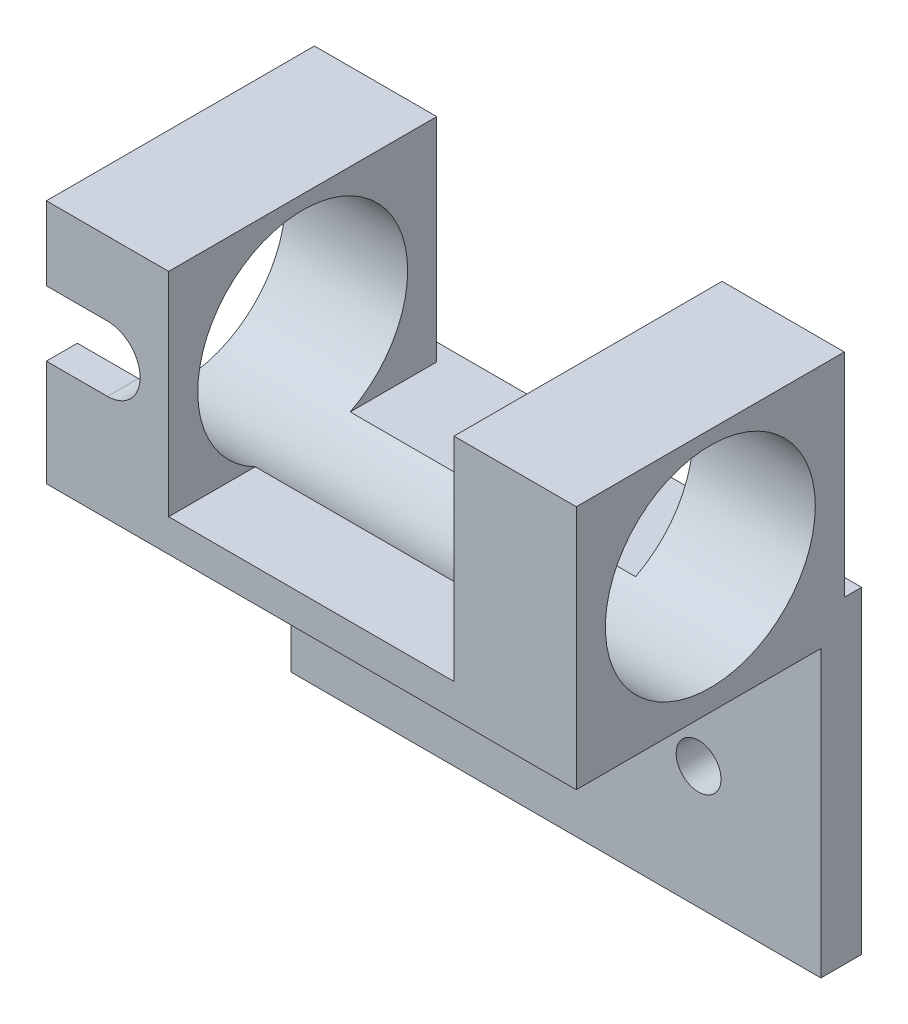
ISO-10303-21;
HEADER;
FILE_DESCRIPTION(('STEP AP214'),'2;1');
FILE_NAME('part.step','',(''),(''),'','','');
FILE_SCHEMA(('AUTOMOTIVE_DESIGN { 1 0 10303 214 1 1 1 1 }'));
ENDSEC;
DATA;
#1=APPLICATION_CONTEXT('core data for automotive mechanical design processes');
#2=APPLICATION_PROTOCOL_DEFINITION('international standard','automotive_design',2000,#1);
#3=PRODUCT_CONTEXT('',#1,'mechanical');
#4=PRODUCT('Part','Part','',(#3));
#5=PRODUCT_RELATED_PRODUCT_CATEGORY('part','',(#4));
#6=PRODUCT_DEFINITION_FORMATION('','',#4);
#7=PRODUCT_DEFINITION_CONTEXT('part definition',#1,'design');
#8=PRODUCT_DEFINITION('design','',#6,#7);
#9=PRODUCT_DEFINITION_SHAPE('','',#8);
#10=(LENGTH_UNIT() NAMED_UNIT(*) SI_UNIT(.MILLI.,.METRE.));
#11=(NAMED_UNIT(*) PLANE_ANGLE_UNIT() SI_UNIT($,.RADIAN.));
#12=(NAMED_UNIT(*) SI_UNIT($,.STERADIAN.) SOLID_ANGLE_UNIT());
#13=UNCERTAINTY_MEASURE_WITH_UNIT(LENGTH_MEASURE(1.E-05),#10,'distance_accuracy_value','');
#14=(GEOMETRIC_REPRESENTATION_CONTEXT(3) GLOBAL_UNCERTAINTY_ASSIGNED_CONTEXT((#13)) GLOBAL_UNIT_ASSIGNED_CONTEXT((#10,
#11,#12)) REPRESENTATION_CONTEXT('',''));
#15=CARTESIAN_POINT('',(0.,0.,0.));
#16=DIRECTION('',(0.,0.,1.));
#17=DIRECTION('',(1.,0.,0.));
#18=AXIS2_PLACEMENT_3D('',#15,#16,#17);
#19=CARTESIAN_POINT('',(-32.5,0.,5.));
#20=DIRECTION('',(-1.,0.,0.));
#21=DIRECTION('',(0.,0.,1.));
#22=AXIS2_PLACEMENT_3D('',#19,#20,#21);
#23=PLANE('',#22);
#24=CARTESIAN_POINT('',(-32.5,27.4823988580113,18.5587747562941));
#25=DIRECTION('',(1.,0.,0.));
#26=DIRECTION('',(0.,0.,-1.));
#27=AXIS2_PLACEMENT_3D('',#24,#25,#26);
#28=CIRCLE('',#27,12.875);
#29=CARTESIAN_POINT('',(-32.5,25.0306720649543,31.1981837904304));
#30=VERTEX_POINT('',#29);
#31=CARTESIAN_POINT('',(-32.5,33.0306720649543,30.1769626279511));
#32=VERTEX_POINT('',#31);
#33=EDGE_CURVE('E189',#30,#32,#28,.T.);
#34=ORIENTED_EDGE('',*,*,#33,.T.);
#35=DIRECTION('',(0.,0.,1.));
#36=VECTOR('',#35,1.);
#37=CARTESIAN_POINT('',(-32.5,33.0306720649543,26.));
#38=LINE('',#37,#36);
#39=CARTESIAN_POINT('',(-32.5,33.0306720649543,35.));
#40=VERTEX_POINT('',#39);
#41=EDGE_CURVE('E171',#32,#40,#38,.T.);
#42=ORIENTED_EDGE('',*,*,#41,.T.);
#43=DIRECTION('',(0.,-1.,0.));
#44=VECTOR('',#43,1.);
#45=CARTESIAN_POINT('',(-32.5,16.,35.));
#46=LINE('',#45,#44);
#47=CARTESIAN_POINT('',(-32.5,42.0613441299086,35.));
#48=VERTEX_POINT('',#47);
#49=EDGE_CURVE('E185',#48,#40,#46,.T.);
#50=ORIENTED_EDGE('',*,*,#49,.F.);
#51=DIRECTION('',(0.,0.,1.));
#52=VECTOR('',#51,1.);
#53=CARTESIAN_POINT('',(-32.5,42.0613441299086,5.));
#54=LINE('',#53,#52);
#55=CARTESIAN_POINT('',(-32.5,42.0613441299086,2.11754951258813));
#56=VERTEX_POINT('',#55);
#57=EDGE_CURVE('E418',#56,#48,#54,.T.);
#58=ORIENTED_EDGE('',*,*,#57,.F.);
#59=DIRECTION('',(0.,1.,0.));
#60=VECTOR('',#59,1.);
#61=CARTESIAN_POINT('',(-32.5,0.,2.11754951258813));
#62=LINE('',#61,#60);
#63=CARTESIAN_POINT('',(-32.5,16.,2.11754951258813));
#64=VERTEX_POINT('',#63);
#65=EDGE_CURVE('E331',#64,#56,#62,.T.);
#66=ORIENTED_EDGE('',*,*,#65,.F.);
#67=DIRECTION('',(0.,0.,1.));
#68=VECTOR('',#67,1.);
#69=CARTESIAN_POINT('',(-32.5,16.,0.));
#70=LINE('',#69,#68);
#71=CARTESIAN_POINT('',(-32.5,16.,0.));
#72=VERTEX_POINT('',#71);
#73=EDGE_CURVE('E323',#72,#64,#70,.T.);
#74=ORIENTED_EDGE('',*,*,#73,.F.);
#75=DIRECTION('',(0.,1.,0.));
#76=VECTOR('',#75,1.);
#77=CARTESIAN_POINT('',(-32.5,0.,0.));
#78=LINE('',#77,#76);
#79=CARTESIAN_POINT('',(-32.5,-23.,0.));
#80=VERTEX_POINT('',#79);
#81=EDGE_CURVE('E239',#80,#72,#78,.T.);
#82=ORIENTED_EDGE('',*,*,#81,.F.);
#83=DIRECTION('',(0.,0.,-1.));
#84=VECTOR('',#83,1.);
#85=CARTESIAN_POINT('',(-32.5,-23.,5.));
#86=LINE('',#85,#84);
#87=CARTESIAN_POINT('',(-32.5,-23.,5.));
#88=VERTEX_POINT('',#87);
#89=EDGE_CURVE('E251',#88,#80,#86,.T.);
#90=ORIENTED_EDGE('',*,*,#89,.F.);
#91=DIRECTION('',(0.,1.,0.));
#92=VECTOR('',#91,1.);
#93=CARTESIAN_POINT('',(-32.5,0.,5.));
#94=LINE('',#93,#92);
#95=CARTESIAN_POINT('',(-32.5,12.,5.));
#96=VERTEX_POINT('',#95);
#97=EDGE_CURVE('E219',#88,#96,#94,.T.);
#98=ORIENTED_EDGE('',*,*,#97,.T.);
#99=DIRECTION('',(0.,0.,1.));
#100=VECTOR('',#99,1.);
#101=CARTESIAN_POINT('',(-32.5,12.,0.));
#102=LINE('',#101,#100);
#103=CARTESIAN_POINT('',(-32.5,12.,35.));
#104=VERTEX_POINT('',#103);
#105=EDGE_CURVE('E348',#96,#104,#102,.T.);
#106=ORIENTED_EDGE('',*,*,#105,.T.);
#107=CARTESIAN_POINT('',(-32.5,25.0306720649543,35.));
#108=VERTEX_POINT('',#107);
#109=EDGE_CURVE('E199',#108,#104,#46,.T.);
#110=ORIENTED_EDGE('',*,*,#109,.F.);
#111=DIRECTION('',(0.,0.,1.));
#112=VECTOR('',#111,1.);
#113=CARTESIAN_POINT('',(-32.5,25.0306720649543,26.));
#114=LINE('',#113,#112);
#115=EDGE_CURVE('E453',#30,#108,#114,.T.);
#116=ORIENTED_EDGE('',*,*,#115,.F.);
#117=EDGE_LOOP('',(#34,#42,#50,#58,#66,#74,#82,#90,#98,#106,#110,#116));
#118=FACE_BOUND('',#117,.T.);
#119=ADVANCED_FACE('F44',(#118),#23,.T.);
#120=CARTESIAN_POINT('',(-32.5,16.,35.));
#121=DIRECTION('',(0.,0.,-1.));
#122=DIRECTION('',(-1.,0.,0.));
#123=AXIS2_PLACEMENT_3D('',#120,#121,#122);
#124=PLANE('',#123);
#125=DIRECTION('',(1.,0.,0.));
#126=VECTOR('',#125,1.);
#127=CARTESIAN_POINT('',(-32.5,33.0306720649543,35.));
#128=LINE('',#127,#126);
#129=CARTESIAN_POINT('',(-25.,33.0306720649543,35.));
#130=VERTEX_POINT('',#129);
#131=EDGE_CURVE('E168',#40,#130,#128,.T.);
#132=ORIENTED_EDGE('',*,*,#131,.T.);
#133=CARTESIAN_POINT('',(-25.,29.0306720649543,35.));
#134=DIRECTION('',(0.,0.,-1.));
#135=DIRECTION('',(-1.,0.,0.));
#136=AXIS2_PLACEMENT_3D('',#133,#134,#135);
#137=CIRCLE('',#136,4.);
#138=CARTESIAN_POINT('',(-25.,25.0306720649543,35.));
#139=VERTEX_POINT('',#138);
#140=EDGE_CURVE('E180',#130,#139,#137,.T.);
#141=ORIENTED_EDGE('',*,*,#140,.T.);
#142=DIRECTION('',(-1.,0.,0.));
#143=VECTOR('',#142,1.);
#144=CARTESIAN_POINT('',(-32.5,25.0306720649543,35.));
#145=LINE('',#144,#143);
#146=EDGE_CURVE('E456',#139,#108,#145,.T.);
#147=ORIENTED_EDGE('',*,*,#146,.T.);
#148=ORIENTED_EDGE('',*,*,#109,.T.);
#149=DIRECTION('',(1.,0.,0.));
#150=VECTOR('',#149,1.);
#151=CARTESIAN_POINT('',(-32.5,12.,35.));
#152=LINE('',#151,#150);
#153=CARTESIAN_POINT('',(32.5,12.,35.));
#154=VERTEX_POINT('',#153);
#155=EDGE_CURVE('E341',#104,#154,#152,.T.);
#156=ORIENTED_EDGE('',*,*,#155,.T.);
#157=DIRECTION('',(0.,-1.,0.));
#158=VECTOR('',#157,1.);
#159=CARTESIAN_POINT('',(32.5,16.,35.));
#160=LINE('',#159,#158);
#161=CARTESIAN_POINT('',(32.5,42.0613441299086,35.));
#162=VERTEX_POINT('',#161);
#163=EDGE_CURVE('E206',#162,#154,#160,.T.);
#164=ORIENTED_EDGE('',*,*,#163,.F.);
#165=DIRECTION('',(1.,0.,0.));
#166=VECTOR('',#165,1.);
#167=CARTESIAN_POINT('',(17.5,42.0613441299086,35.));
#168=LINE('',#167,#166);
#169=CARTESIAN_POINT('',(17.5,42.0613441299086,35.));
#170=VERTEX_POINT('',#169);
#171=EDGE_CURVE('E352',#170,#162,#168,.T.);
#172=ORIENTED_EDGE('',*,*,#171,.F.);
#173=DIRECTION('',(0.,1.,0.));
#174=VECTOR('',#173,1.);
#175=CARTESIAN_POINT('',(17.5,0.,35.));
#176=LINE('',#175,#174);
#177=CARTESIAN_POINT('',(17.5,16.,35.));
#178=VERTEX_POINT('',#177);
#179=EDGE_CURVE('E380',#178,#170,#176,.T.);
#180=ORIENTED_EDGE('',*,*,#179,.F.);
#181=DIRECTION('',(1.,0.,0.));
#182=VECTOR('',#181,1.);
#183=CARTESIAN_POINT('',(-32.5,16.,35.));
#184=LINE('',#183,#182);
#185=CARTESIAN_POINT('',(-17.5,16.,35.));
#186=VERTEX_POINT('',#185);
#187=EDGE_CURVE('E333',#186,#178,#184,.T.);
#188=ORIENTED_EDGE('',*,*,#187,.F.);
#189=DIRECTION('',(0.,-1.,0.));
#190=VECTOR('',#189,1.);
#191=CARTESIAN_POINT('',(-17.5,0.,35.));
#192=LINE('',#191,#190);
#193=CARTESIAN_POINT('',(-17.5,42.0613441299086,35.));
#194=VERTEX_POINT('',#193);
#195=EDGE_CURVE('E429',#194,#186,#192,.T.);
#196=ORIENTED_EDGE('',*,*,#195,.F.);
#197=DIRECTION('',(-1.,0.,0.));
#198=VECTOR('',#197,1.);
#199=CARTESIAN_POINT('',(-17.5,42.0613441299086,35.));
#200=LINE('',#199,#198);
#201=EDGE_CURVE('E195',#194,#48,#200,.T.);
#202=ORIENTED_EDGE('',*,*,#201,.T.);
#203=ORIENTED_EDGE('',*,*,#49,.T.);
#204=EDGE_LOOP('',(#132,#141,#147,#148,#156,#164,#172,#180,#188,#196,#202,#203));
#205=FACE_BOUND('',#204,.T.);
#206=ADVANCED_FACE('F193',(#205),#124,.F.);
#207=CARTESIAN_POINT('',(-32.5,27.4823988580113,18.5587747562941));
#208=DIRECTION('',(1.,0.,0.));
#209=DIRECTION('',(0.,0.,-1.));
#210=AXIS2_PLACEMENT_3D('',#207,#208,#209);
#211=CYLINDRICAL_SURFACE('',#210,12.875);
#212=DIRECTION('',(1.,0.,0.));
#213=VECTOR('',#212,1.);
#214=CARTESIAN_POINT('',(-32.5,16.,12.7346747000157));
#215=LINE('',#214,#213);
#216=CARTESIAN_POINT('',(17.5,16.,12.7346747000157));
#217=VERTEX_POINT('',#216);
#218=CARTESIAN_POINT('',(-17.5,16.,12.7346747000157));
#219=VERTEX_POINT('',#218);
#220=EDGE_CURVE('E68',#217,#219,#215,.F.);
#221=ORIENTED_EDGE('',*,*,#220,.T.);
#222=CARTESIAN_POINT('',(-17.5,27.4823988580113,18.5587747562941));
#223=DIRECTION('',(1.,0.,0.));
#224=DIRECTION('',(0.,0.,-1.));
#225=AXIS2_PLACEMENT_3D('',#222,#223,#224);
#226=CIRCLE('',#225,12.875);
#227=CARTESIAN_POINT('',(-17.5,16.,24.3828748125724));
#228=VERTEX_POINT('',#227);
#229=EDGE_CURVE('E254',#219,#228,#226,.T.);
#230=ORIENTED_EDGE('',*,*,#229,.T.);
#231=DIRECTION('',(1.,0.,0.));
#232=VECTOR('',#231,1.);
#233=CARTESIAN_POINT('',(-32.5,16.,24.3828748125724));
#234=LINE('',#233,#232);
#235=CARTESIAN_POINT('',(17.5,16.,24.3828748125724));
#236=VERTEX_POINT('',#235);
#237=EDGE_CURVE('E439',#228,#236,#234,.T.);
#238=ORIENTED_EDGE('',*,*,#237,.T.);
#239=CARTESIAN_POINT('',(17.5,27.4823988580113,18.5587747562941));
#240=DIRECTION('',(1.,0.,0.));
#241=DIRECTION('',(0.,0.,-1.));
#242=AXIS2_PLACEMENT_3D('',#239,#240,#241);
#243=CIRCLE('',#242,12.875);
#244=EDGE_CURVE('E421',#217,#236,#243,.T.);
#245=ORIENTED_EDGE('',*,*,#244,.F.);
#246=EDGE_LOOP('',(#221,#230,#238,#245));
#247=FACE_BOUND('',#246,.T.);
#248=CARTESIAN_POINT('',(32.5,27.4823988580113,18.5587747562941));
#249=DIRECTION('',(1.,0.,0.));
#250=DIRECTION('',(0.,0.,-1.));
#251=AXIS2_PLACEMENT_3D('',#248,#249,#250);
#252=CIRCLE('',#251,12.875);
#253=CARTESIAN_POINT('',(32.5,27.4823988580113,5.68377475629407));
#254=VERTEX_POINT('',#253);
#255=EDGE_CURVE('E191',#254,#254,#252,.T.);
#256=ORIENTED_EDGE('',*,*,#255,.T.);
#257=EDGE_LOOP('',(#256));
#258=FACE_BOUND('',#257,.T.);
#259=DIRECTION('',(1.,0.,0.));
#260=VECTOR('',#259,1.);
#261=CARTESIAN_POINT('',(-32.5,33.0306720649543,30.1769626279511));
#262=LINE('',#261,#260);
#263=CARTESIAN_POINT('',(-25.,33.0306720649543,30.1769626279511));
#264=VERTEX_POINT('',#263);
#265=EDGE_CURVE('E11',#32,#264,#262,.T.);
#266=ORIENTED_EDGE('',*,*,#265,.F.);
#267=ORIENTED_EDGE('',*,*,#33,.F.);
#268=DIRECTION('',(1.,0.,0.));
#269=VECTOR('',#268,1.);
#270=CARTESIAN_POINT('',(-32.5,25.0306720649543,31.1981837904304));
#271=LINE('',#270,#269);
#272=CARTESIAN_POINT('',(-25.,25.0306720649543,31.1981837904304));
#273=VERTEX_POINT('',#272);
#274=EDGE_CURVE('E257',#273,#30,#271,.F.);
#275=ORIENTED_EDGE('',*,*,#274,.F.);
#276=CARTESIAN_POINT('',(-25.,33.0306720649543,30.1769626279511));
#277=CARTESIAN_POINT('',(-24.8937564411427,33.0306886288787,30.1769430156584));
#278=CARTESIAN_POINT('',(-24.787524880278,33.026439636745,30.1789835569587));
#279=CARTESIAN_POINT('',(-24.5759241324795,33.0095394609513,30.1870377945326));
#280=CARTESIAN_POINT('',(-24.4705546253874,32.9968915546872,30.1930499410151));
#281=CARTESIAN_POINT('',(-24.2618716634726,32.9633928231388,30.2088671437858));
#282=CARTESIAN_POINT('',(-24.1585514291081,32.9425766933838,30.2186561544734));
#283=CARTESIAN_POINT('',(-23.9542630890447,32.8929896457858,30.2417485723977));
#284=CARTESIAN_POINT('',(-23.8532951281833,32.8642182395056,30.2550521954221));
#285=CARTESIAN_POINT('',(-23.5551720309419,32.7664556465641,30.2997094881737));
#286=CARTESIAN_POINT('',(-23.3623682684814,32.6859459458424,30.33584424429));
#287=CARTESIAN_POINT('',(-22.9931211471938,32.4970231981547,30.4175143840351));
#288=CARTESIAN_POINT('',(-22.8166939768386,32.3885829327819,30.4630589289129));
#289=CARTESIAN_POINT('',(-22.4743079252867,32.1400222065427,30.5625673823734));
#290=CARTESIAN_POINT('',(-22.3094807870485,31.9984727509403,30.6168590918156));
#291=CARTESIAN_POINT('',(-22.0051441386621,31.6910602788678,30.7275658646432));
#292=CARTESIAN_POINT('',(-21.8656423354644,31.525189888771,30.7839815681128));
#293=CARTESIAN_POINT('',(-21.6064316789472,31.160696716471,30.8987350430125));
#294=CARTESIAN_POINT('',(-21.4887060331883,30.9606158075347,30.9569437999301));
#295=CARTESIAN_POINT('',(-21.2890993422552,30.5416445971929,31.0669117737683));
#296=CARTESIAN_POINT('',(-21.2072148285403,30.3227561183517,31.1186716144386));
#297=CARTESIAN_POINT('',(-21.0834878319675,29.8755833038296,31.2114254813977));
#298=CARTESIAN_POINT('',(-21.0410328314095,29.6475021946198,31.2525767582008));
#299=CARTESIAN_POINT('',(-20.9962812603364,29.1856146836563,31.322753626361));
#300=CARTESIAN_POINT('',(-20.9939684554071,28.951810634701,31.3517841150038));
#301=CARTESIAN_POINT('',(-21.029301004751,28.4996567806319,31.3954190946134));
#302=CARTESIAN_POINT('',(-21.0646411022631,28.2811958158225,31.410761370628));
#303=CARTESIAN_POINT('',(-21.1710337656936,27.8526485738328,31.4302371697413));
#304=CARTESIAN_POINT('',(-21.242081879588,27.6425612561617,31.4343720897464));
#305=CARTESIAN_POINT('',(-21.4158290158564,27.2417163153661,31.4330518841067));
#306=CARTESIAN_POINT('',(-21.5177656908448,27.0506261353676,31.4278142783952));
#307=CARTESIAN_POINT('',(-21.7509269523289,26.6875824116382,31.4105046442081));
#308=CARTESIAN_POINT('',(-21.8821548434165,26.5156310304013,31.3984318443596));
#309=CARTESIAN_POINT('',(-22.1736840386001,26.1915581722493,31.3699601465789));
#310=CARTESIAN_POINT('',(-22.3345890493781,26.0399891013387,31.3534674081707));
#311=CARTESIAN_POINT('',(-22.6792147456001,25.7653301427361,31.3195158872238));
#312=CARTESIAN_POINT('',(-22.8629421060584,25.6422486172789,31.3020568228885));
#313=CARTESIAN_POINT('',(-23.1539895636922,25.4803181388035,31.2772794188998));
#314=CARTESIAN_POINT('',(-23.254853826961,25.4296709845708,31.2691694402778));
#315=CARTESIAN_POINT('',(-23.460546863978,25.3370581867841,31.253866103742));
#316=CARTESIAN_POINT('',(-23.5653741674278,25.295089360218,31.246672410129));
#317=CARTESIAN_POINT('',(-23.7781915957235,25.2201725316003,31.2335293877825));
#318=CARTESIAN_POINT('',(-23.8861794846777,25.1872183153066,31.227579202505));
#319=CARTESIAN_POINT('',(-24.1045840233819,25.1305498498851,31.2171812966717));
#320=CARTESIAN_POINT('',(-24.2149997491385,25.1068321476658,31.2127330147089));
#321=CARTESIAN_POINT('',(-24.4375170533765,25.0688104262569,31.2055376937941));
#322=CARTESIAN_POINT('',(-24.5496189465558,25.0545081871919,31.2027909765523));
#323=CARTESIAN_POINT('',(-24.7744800688903,25.035439716368,31.1991082322418));
#324=CARTESIAN_POINT('',(-24.8872379697631,25.0306583611978,31.198169333629));
#325=CARTESIAN_POINT('',(-25.,25.0306720649543,31.1981837904304));
#326=B_SPLINE_CURVE_WITH_KNOTS('',3,(#276,#277,#278,#279,#280,#281,#282,#283,#284,#285,#286,
#287,#288,#289,#290,#291,#292,#293,#294,#295,#296,#297,#298,#299,#300,#301,#302,#303,#304,#305,
#306,#307,#308,#309,#310,#311,#312,#313,#314,#315,#316,#317,#318,#319,#320,#321,#322,#323,#324,
#325),.UNSPECIFIED.,.F.,.F.,(4,2,2,2,2,2,2,2,2,2,2,2,2,2,2,2,2,2,2,2,2,2,2,2,4),(0.,
0.318606185657265,0.637088118883368,0.954231655267756,1.27139466792001,1.90442776450958,
2.53808010300269,3.20705412667005,3.87623139102759,4.59077849514408,5.30525643336669,
6.00843998766827,6.71133915196588,7.37355049927307,8.03567930349555,8.68263998526856,
9.32967369312185,9.99171395518003,10.6539483067798,10.9930830303084,11.3320931454751,
11.6708689709298,12.0095180224193,12.3482310818553,12.686405683277),.UNSPECIFIED.);
#327=EDGE_CURVE('E53',#264,#273,#326,.T.);
#328=ORIENTED_EDGE('',*,*,#327,.F.);
#329=EDGE_LOOP('',(#266,#267,#275,#328));
#330=FACE_BOUND('',#329,.T.);
#331=ADVANCED_FACE('F266',(#247,#258,#330),#211,.F.);
#332=CARTESIAN_POINT('',(0.,16.,0.));
#333=DIRECTION('',(0.,1.,0.));
#334=DIRECTION('',(-1.,0.,0.));
#335=AXIS2_PLACEMENT_3D('',#332,#333,#334);
#336=PLANE('',#335);
#337=ORIENTED_EDGE('',*,*,#237,.F.);
#338=DIRECTION('',(0.,0.,-1.));
#339=VECTOR('',#338,1.);
#340=CARTESIAN_POINT('',(-17.5,16.,5.));
#341=LINE('',#340,#339);
#342=EDGE_CURVE('E424',#186,#228,#341,.T.);
#343=ORIENTED_EDGE('',*,*,#342,.F.);
#344=ORIENTED_EDGE('',*,*,#187,.T.);
#345=DIRECTION('',(0.,0.,1.));
#346=VECTOR('',#345,1.);
#347=CARTESIAN_POINT('',(17.5,16.,0.));
#348=LINE('',#347,#346);
#349=EDGE_CURVE('E403',#236,#178,#348,.T.);
#350=ORIENTED_EDGE('',*,*,#349,.F.);
#351=EDGE_LOOP('',(#337,#343,#344,#350));
#352=FACE_BOUND('',#351,.T.);
#353=ADVANCED_FACE('F464',(#352),#336,.T.);
#354=ORIENTED_EDGE('',*,*,#220,.F.);
#355=CARTESIAN_POINT('',(17.5,16.,2.11754951258813));
#356=VERTEX_POINT('',#355);
#357=EDGE_CURVE('E400',#356,#217,#348,.T.);
#358=ORIENTED_EDGE('',*,*,#357,.F.);
#359=DIRECTION('',(1.,0.,0.));
#360=VECTOR('',#359,1.);
#361=CARTESIAN_POINT('',(17.5,16.,2.11754951258813));
#362=LINE('',#361,#360);
#363=CARTESIAN_POINT('',(32.5,16.,2.11754951258813));
#364=VERTEX_POINT('',#363);
#365=EDGE_CURVE('E343',#356,#364,#362,.T.);
#366=ORIENTED_EDGE('',*,*,#365,.T.);
#367=DIRECTION('',(0.,0.,-1.));
#368=VECTOR('',#367,1.);
#369=CARTESIAN_POINT('',(32.5,16.,0.));
#370=LINE('',#369,#368);
#371=CARTESIAN_POINT('',(32.5,16.,0.));
#372=VERTEX_POINT('',#371);
#373=EDGE_CURVE('E327',#364,#372,#370,.T.);
#374=ORIENTED_EDGE('',*,*,#373,.T.);
#375=DIRECTION('',(-1.,0.,0.));
#376=VECTOR('',#375,1.);
#377=CARTESIAN_POINT('',(-32.5,16.,0.));
#378=LINE('',#377,#376);
#379=EDGE_CURVE('E317',#372,#72,#378,.T.);
#380=ORIENTED_EDGE('',*,*,#379,.T.);
#381=ORIENTED_EDGE('',*,*,#73,.T.);
#382=DIRECTION('',(-1.,0.,0.));
#383=VECTOR('',#382,1.);
#384=CARTESIAN_POINT('',(-17.5,16.,2.11754951258813));
#385=LINE('',#384,#383);
#386=CARTESIAN_POINT('',(-17.5,16.,2.11754951258813));
#387=VERTEX_POINT('',#386);
#388=EDGE_CURVE('E382',#387,#64,#385,.T.);
#389=ORIENTED_EDGE('',*,*,#388,.F.);
#390=EDGE_CURVE('E428',#219,#387,#341,.T.);
#391=ORIENTED_EDGE('',*,*,#390,.F.);
#392=EDGE_LOOP('',(#354,#358,#366,#374,#380,#381,#389,#391));
#393=FACE_BOUND('',#392,.T.);
#394=ADVANCED_FACE('F321',(#393),#336,.T.);
#395=CARTESIAN_POINT('',(0.,-23.,5.));
#396=DIRECTION('',(0.,-1.,0.));
#397=DIRECTION('',(1.,0.,0.));
#398=AXIS2_PLACEMENT_3D('',#395,#396,#397);
#399=PLANE('',#398);
#400=DIRECTION('',(-1.,0.,0.));
#401=VECTOR('',#400,1.);
#402=CARTESIAN_POINT('',(0.,-23.,0.));
#403=LINE('',#402,#401);
#404=CARTESIAN_POINT('',(32.5,-23.,0.));
#405=VERTEX_POINT('',#404);
#406=EDGE_CURVE('E242',#405,#80,#403,.T.);
#407=ORIENTED_EDGE('',*,*,#406,.F.);
#408=DIRECTION('',(0.,0.,-1.));
#409=VECTOR('',#408,1.);
#410=CARTESIAN_POINT('',(32.5,-23.,5.));
#411=LINE('',#410,#409);
#412=CARTESIAN_POINT('',(32.5,-23.,5.));
#413=VERTEX_POINT('',#412);
#414=EDGE_CURVE('E234',#413,#405,#411,.T.);
#415=ORIENTED_EDGE('',*,*,#414,.F.);
#416=DIRECTION('',(-1.,0.,0.));
#417=VECTOR('',#416,1.);
#418=CARTESIAN_POINT('',(0.,-23.,5.));
#419=LINE('',#418,#417);
#420=EDGE_CURVE('E223',#413,#88,#419,.T.);
#421=ORIENTED_EDGE('',*,*,#420,.T.);
#422=ORIENTED_EDGE('',*,*,#89,.T.);
#423=EDGE_LOOP('',(#407,#415,#421,#422));
#424=FACE_BOUND('',#423,.T.);
#425=ADVANCED_FACE('F290',(#424),#399,.T.);
#426=CARTESIAN_POINT('',(32.5,0.,5.));
#427=DIRECTION('',(-1.,0.,0.));
#428=DIRECTION('',(0.,0.,1.));
#429=AXIS2_PLACEMENT_3D('',#426,#427,#428);
#430=PLANE('',#429);
#431=ORIENTED_EDGE('',*,*,#255,.F.);
#432=EDGE_LOOP('',(#431));
#433=FACE_BOUND('',#432,.T.);
#434=DIRECTION('',(0.,1.,0.));
#435=VECTOR('',#434,1.);
#436=CARTESIAN_POINT('',(32.5,0.,0.));
#437=LINE('',#436,#435);
#438=EDGE_CURVE('E215',#405,#372,#437,.T.);
#439=ORIENTED_EDGE('',*,*,#438,.T.);
#440=ORIENTED_EDGE('',*,*,#373,.F.);
#441=DIRECTION('',(0.,-1.,0.));
#442=VECTOR('',#441,1.);
#443=CARTESIAN_POINT('',(32.5,0.,2.11754951258813));
#444=LINE('',#443,#442);
#445=CARTESIAN_POINT('',(32.5,42.0613441299086,2.11754951258813));
#446=VERTEX_POINT('',#445);
#447=EDGE_CURVE('E372',#446,#364,#444,.T.);
#448=ORIENTED_EDGE('',*,*,#447,.F.);
#449=DIRECTION('',(0.,0.,-1.));
#450=VECTOR('',#449,1.);
#451=CARTESIAN_POINT('',(32.5,42.0613441299086,0.));
#452=LINE('',#451,#450);
#453=EDGE_CURVE('E365',#162,#446,#452,.T.);
#454=ORIENTED_EDGE('',*,*,#453,.F.);
#455=ORIENTED_EDGE('',*,*,#163,.T.);
#456=DIRECTION('',(0.,0.,-1.));
#457=VECTOR('',#456,1.);
#458=CARTESIAN_POINT('',(32.5,12.,0.));
#459=LINE('',#458,#457);
#460=CARTESIAN_POINT('',(32.5,12.,5.));
#461=VERTEX_POINT('',#460);
#462=EDGE_CURVE('E334',#154,#461,#459,.T.);
#463=ORIENTED_EDGE('',*,*,#462,.T.);
#464=DIRECTION('',(0.,1.,0.));
#465=VECTOR('',#464,1.);
#466=CARTESIAN_POINT('',(32.5,0.,5.));
#467=LINE('',#466,#465);
#468=EDGE_CURVE('E227',#413,#461,#467,.T.);
#469=ORIENTED_EDGE('',*,*,#468,.F.);
#470=ORIENTED_EDGE('',*,*,#414,.T.);
#471=EDGE_LOOP('',(#439,#440,#448,#454,#455,#463,#469,#470));
#472=FACE_BOUND('',#471,.T.);
#473=ADVANCED_FACE('F294',(#433,#472),#430,.F.);
#474=CARTESIAN_POINT('',(-17.5,-8.00000000000001,5.));
#475=DIRECTION('',(0.,0.,-1.));
#476=DIRECTION('',(-1.,0.,0.));
#477=AXIS2_PLACEMENT_3D('',#474,#475,#476);
#478=CYLINDRICAL_SURFACE('',#477,2.75);
#479=CARTESIAN_POINT('',(-17.5,-8.00000000000001,5.));
#480=DIRECTION('',(0.,0.,1.));
#481=DIRECTION('',(1.,0.,0.));
#482=AXIS2_PLACEMENT_3D('',#479,#480,#481);
#483=CIRCLE('',#482,2.75);
#484=CARTESIAN_POINT('',(-14.75,-8.00000000000001,5.));
#485=VERTEX_POINT('',#484);
#486=EDGE_CURVE('E214',#485,#485,#483,.T.);
#487=ORIENTED_EDGE('',*,*,#486,.T.);
#488=EDGE_LOOP('',(#487));
#489=FACE_BOUND('',#488,.T.);
#490=CARTESIAN_POINT('',(-17.5,-8.00000000000001,0.));
#491=DIRECTION('',(0.,0.,1.));
#492=DIRECTION('',(1.,0.,0.));
#493=AXIS2_PLACEMENT_3D('',#490,#491,#492);
#494=CIRCLE('',#493,2.75);
#495=CARTESIAN_POINT('',(-14.75,-8.00000000000001,0.));
#496=VERTEX_POINT('',#495);
#497=EDGE_CURVE('E204',#496,#496,#494,.T.);
#498=ORIENTED_EDGE('',*,*,#497,.F.);
#499=EDGE_LOOP('',(#498));
#500=FACE_BOUND('',#499,.T.);
#501=ADVANCED_FACE('F292',(#489,#500),#478,.F.);
#502=CARTESIAN_POINT('',(17.5,-8.,5.));
#503=DIRECTION('',(0.,0.,-1.));
#504=DIRECTION('',(-1.,0.,0.));
#505=AXIS2_PLACEMENT_3D('',#502,#503,#504);
#506=CYLINDRICAL_SURFACE('',#505,2.75);
#507=CARTESIAN_POINT('',(17.5,-8.,5.));
#508=DIRECTION('',(0.,0.,1.));
#509=DIRECTION('',(1.,0.,0.));
#510=AXIS2_PLACEMENT_3D('',#507,#508,#509);
#511=CIRCLE('',#510,2.75);
#512=CARTESIAN_POINT('',(20.25,-8.,5.));
#513=VERTEX_POINT('',#512);
#514=EDGE_CURVE('E210',#513,#513,#511,.T.);
#515=ORIENTED_EDGE('',*,*,#514,.T.);
#516=EDGE_LOOP('',(#515));
#517=FACE_BOUND('',#516,.T.);
#518=CARTESIAN_POINT('',(17.5,-8.,0.));
#519=DIRECTION('',(0.,0.,1.));
#520=DIRECTION('',(1.,0.,0.));
#521=AXIS2_PLACEMENT_3D('',#518,#519,#520);
#522=CIRCLE('',#521,2.75);
#523=CARTESIAN_POINT('',(20.25,-8.,0.));
#524=VERTEX_POINT('',#523);
#525=EDGE_CURVE('E198',#524,#524,#522,.T.);
#526=ORIENTED_EDGE('',*,*,#525,.F.);
#527=EDGE_LOOP('',(#526));
#528=FACE_BOUND('',#527,.T.);
#529=ADVANCED_FACE('F46',(#517,#528),#506,.F.);
#530=CARTESIAN_POINT('',(0.,0.,5.));
#531=DIRECTION('',(0.,0.,1.));
#532=DIRECTION('',(1.,0.,0.));
#533=AXIS2_PLACEMENT_3D('',#530,#531,#532);
#534=PLANE('',#533);
#535=ORIENTED_EDGE('',*,*,#514,.F.);
#536=EDGE_LOOP('',(#535));
#537=FACE_BOUND('',#536,.T.);
#538=ORIENTED_EDGE('',*,*,#486,.F.);
#539=EDGE_LOOP('',(#538));
#540=FACE_BOUND('',#539,.T.);
#541=ORIENTED_EDGE('',*,*,#97,.F.);
#542=ORIENTED_EDGE('',*,*,#420,.F.);
#543=ORIENTED_EDGE('',*,*,#468,.T.);
#544=DIRECTION('',(-1.,0.,0.));
#545=VECTOR('',#544,1.);
#546=CARTESIAN_POINT('',(0.,12.,5.));
#547=LINE('',#546,#545);
#548=EDGE_CURVE('E231',#461,#96,#547,.T.);
#549=ORIENTED_EDGE('',*,*,#548,.T.);
#550=EDGE_LOOP('',(#541,#542,#543,#549));
#551=FACE_BOUND('',#550,.T.);
#552=ADVANCED_FACE('F300',(#537,#540,#551),#534,.T.);
#553=CARTESIAN_POINT('',(0.,0.,0.));
#554=DIRECTION('',(0.,0.,1.));
#555=DIRECTION('',(1.,0.,0.));
#556=AXIS2_PLACEMENT_3D('',#553,#554,#555);
#557=PLANE('',#556);
#558=ORIENTED_EDGE('',*,*,#525,.T.);
#559=EDGE_LOOP('',(#558));
#560=FACE_BOUND('',#559,.T.);
#561=ORIENTED_EDGE('',*,*,#497,.T.);
#562=EDGE_LOOP('',(#561));
#563=FACE_BOUND('',#562,.T.);
#564=ORIENTED_EDGE('',*,*,#81,.T.);
#565=ORIENTED_EDGE('',*,*,#379,.F.);
#566=ORIENTED_EDGE('',*,*,#438,.F.);
#567=ORIENTED_EDGE('',*,*,#406,.T.);
#568=EDGE_LOOP('',(#564,#565,#566,#567));
#569=FACE_BOUND('',#568,.T.);
#570=ADVANCED_FACE('F307',(#560,#563,#569),#557,.F.);
#571=CARTESIAN_POINT('',(0.,12.,0.));
#572=DIRECTION('',(0.,1.,0.));
#573=DIRECTION('',(-1.,0.,0.));
#574=AXIS2_PLACEMENT_3D('',#571,#572,#573);
#575=PLANE('',#574);
#576=ORIENTED_EDGE('',*,*,#548,.F.);
#577=ORIENTED_EDGE('',*,*,#462,.F.);
#578=ORIENTED_EDGE('',*,*,#155,.F.);
#579=ORIENTED_EDGE('',*,*,#105,.F.);
#580=EDGE_LOOP('',(#576,#577,#578,#579));
#581=FACE_BOUND('',#580,.T.);
#582=ADVANCED_FACE('F310',(#581),#575,.F.);
#583=CARTESIAN_POINT('',(17.5,42.0613441299086,0.));
#584=DIRECTION('',(0.,-1.,0.));
#585=DIRECTION('',(0.,0.,-1.));
#586=AXIS2_PLACEMENT_3D('',#583,#584,#585);
#587=PLANE('',#586);
#588=ORIENTED_EDGE('',*,*,#453,.T.);
#589=DIRECTION('',(1.,0.,0.));
#590=VECTOR('',#589,1.);
#591=CARTESIAN_POINT('',(17.5,42.0613441299086,2.11754951258813));
#592=LINE('',#591,#590);
#593=CARTESIAN_POINT('',(17.5,42.0613441299086,2.11754951258813));
#594=VERTEX_POINT('',#593);
#595=EDGE_CURVE('E389',#594,#446,#592,.T.);
#596=ORIENTED_EDGE('',*,*,#595,.F.);
#597=DIRECTION('',(0.,0.,-1.));
#598=VECTOR('',#597,1.);
#599=CARTESIAN_POINT('',(17.5,42.0613441299086,0.));
#600=LINE('',#599,#598);
#601=EDGE_CURVE('E385',#170,#594,#600,.T.);
#602=ORIENTED_EDGE('',*,*,#601,.F.);
#603=ORIENTED_EDGE('',*,*,#171,.T.);
#604=EDGE_LOOP('',(#588,#596,#602,#603));
#605=FACE_BOUND('',#604,.T.);
#606=ADVANCED_FACE('F481',(#605),#587,.F.);
#607=CARTESIAN_POINT('',(17.5,0.,2.11754951258813));
#608=DIRECTION('',(0.,0.,1.));
#609=DIRECTION('',(1.,0.,0.));
#610=AXIS2_PLACEMENT_3D('',#607,#608,#609);
#611=PLANE('',#610);
#612=ORIENTED_EDGE('',*,*,#447,.T.);
#613=ORIENTED_EDGE('',*,*,#365,.F.);
#614=DIRECTION('',(0.,-1.,0.));
#615=VECTOR('',#614,1.);
#616=CARTESIAN_POINT('',(17.5,0.,2.11754951258813));
#617=LINE('',#616,#615);
#618=EDGE_CURVE('E396',#594,#356,#617,.T.);
#619=ORIENTED_EDGE('',*,*,#618,.F.);
#620=ORIENTED_EDGE('',*,*,#595,.T.);
#621=EDGE_LOOP('',(#612,#613,#619,#620));
#622=FACE_BOUND('',#621,.T.);
#623=ADVANCED_FACE('F478',(#622),#611,.F.);
#624=CARTESIAN_POINT('',(17.5,0.,0.));
#625=DIRECTION('',(1.,0.,0.));
#626=DIRECTION('',(0.,0.,-1.));
#627=AXIS2_PLACEMENT_3D('',#624,#625,#626);
#628=PLANE('',#627);
#629=ORIENTED_EDGE('',*,*,#357,.T.);
#630=ORIENTED_EDGE('',*,*,#244,.T.);
#631=ORIENTED_EDGE('',*,*,#349,.T.);
#632=ORIENTED_EDGE('',*,*,#179,.T.);
#633=ORIENTED_EDGE('',*,*,#601,.T.);
#634=ORIENTED_EDGE('',*,*,#618,.T.);
#635=EDGE_LOOP('',(#629,#630,#631,#632,#633,#634));
#636=FACE_BOUND('',#635,.T.);
#637=ADVANCED_FACE('F513',(#636),#628,.F.);
#638=CARTESIAN_POINT('',(-17.5,42.0613441299086,5.));
#639=DIRECTION('',(0.,-1.,0.));
#640=DIRECTION('',(0.,0.,-1.));
#641=AXIS2_PLACEMENT_3D('',#638,#639,#640);
#642=PLANE('',#641);
#643=ORIENTED_EDGE('',*,*,#57,.T.);
#644=ORIENTED_EDGE('',*,*,#201,.F.);
#645=DIRECTION('',(0.,0.,1.));
#646=VECTOR('',#645,1.);
#647=CARTESIAN_POINT('',(-17.5,42.0613441299086,5.));
#648=LINE('',#647,#646);
#649=CARTESIAN_POINT('',(-17.5,42.0613441299086,2.11754951258813));
#650=VERTEX_POINT('',#649);
#651=EDGE_CURVE('E417',#650,#194,#648,.T.);
#652=ORIENTED_EDGE('',*,*,#651,.F.);
#653=DIRECTION('',(-1.,0.,0.));
#654=VECTOR('',#653,1.);
#655=CARTESIAN_POINT('',(-17.5,42.0613441299086,2.11754951258813));
#656=LINE('',#655,#654);
#657=EDGE_CURVE('E410',#650,#56,#656,.T.);
#658=ORIENTED_EDGE('',*,*,#657,.T.);
#659=EDGE_LOOP('',(#643,#644,#652,#658));
#660=FACE_BOUND('',#659,.T.);
#661=ADVANCED_FACE('F520',(#660),#642,.F.);
#662=CARTESIAN_POINT('',(-17.5,0.,2.11754951258813));
#663=DIRECTION('',(0.,0.,1.));
#664=DIRECTION('',(1.,0.,0.));
#665=AXIS2_PLACEMENT_3D('',#662,#663,#664);
#666=PLANE('',#665);
#667=ORIENTED_EDGE('',*,*,#65,.T.);
#668=ORIENTED_EDGE('',*,*,#657,.F.);
#669=DIRECTION('',(0.,1.,0.));
#670=VECTOR('',#669,1.);
#671=CARTESIAN_POINT('',(-17.5,0.,2.11754951258813));
#672=LINE('',#671,#670);
#673=EDGE_CURVE('E414',#387,#650,#672,.T.);
#674=ORIENTED_EDGE('',*,*,#673,.F.);
#675=ORIENTED_EDGE('',*,*,#388,.T.);
#676=EDGE_LOOP('',(#667,#668,#674,#675));
#677=FACE_BOUND('',#676,.T.);
#678=ADVANCED_FACE('F281',(#677),#666,.F.);
#679=CARTESIAN_POINT('',(-17.5,0.,0.));
#680=DIRECTION('',(1.,0.,0.));
#681=DIRECTION('',(0.,0.,-1.));
#682=AXIS2_PLACEMENT_3D('',#679,#680,#681);
#683=PLANE('',#682);
#684=ORIENTED_EDGE('',*,*,#229,.F.);
#685=ORIENTED_EDGE('',*,*,#390,.T.);
#686=ORIENTED_EDGE('',*,*,#673,.T.);
#687=ORIENTED_EDGE('',*,*,#651,.T.);
#688=ORIENTED_EDGE('',*,*,#195,.T.);
#689=ORIENTED_EDGE('',*,*,#342,.T.);
#690=EDGE_LOOP('',(#684,#685,#686,#687,#688,#689));
#691=FACE_BOUND('',#690,.T.);
#692=ADVANCED_FACE('F277',(#691),#683,.T.);
#693=CARTESIAN_POINT('',(-32.5,33.0306720649543,26.));
#694=DIRECTION('',(0.,-1.,0.));
#695=DIRECTION('',(0.,0.,-1.));
#696=AXIS2_PLACEMENT_3D('',#693,#694,#695);
#697=PLANE('',#696);
#698=ORIENTED_EDGE('',*,*,#265,.T.);
#699=DIRECTION('',(0.,0.,1.));
#700=VECTOR('',#699,1.);
#701=CARTESIAN_POINT('',(-25.,33.0306720649543,26.));
#702=LINE('',#701,#700);
#703=EDGE_CURVE('E174',#264,#130,#702,.T.);
#704=ORIENTED_EDGE('',*,*,#703,.T.);
#705=ORIENTED_EDGE('',*,*,#131,.F.);
#706=ORIENTED_EDGE('',*,*,#41,.F.);
#707=EDGE_LOOP('',(#698,#704,#705,#706));
#708=FACE_BOUND('',#707,.T.);
#709=ADVANCED_FACE('F170',(#708),#697,.T.);
#710=CARTESIAN_POINT('',(-25.,29.0306720649543,26.));
#711=DIRECTION('',(0.,0.,1.));
#712=DIRECTION('',(1.,0.,0.));
#713=AXIS2_PLACEMENT_3D('',#710,#711,#712);
#714=CYLINDRICAL_SURFACE('',#713,4.);
#715=ORIENTED_EDGE('',*,*,#327,.T.);
#716=DIRECTION('',(0.,0.,1.));
#717=VECTOR('',#716,1.);
#718=CARTESIAN_POINT('',(-25.,25.0306720649543,26.));
#719=LINE('',#718,#717);
#720=EDGE_CURVE('E60',#273,#139,#719,.T.);
#721=ORIENTED_EDGE('',*,*,#720,.T.);
#722=ORIENTED_EDGE('',*,*,#140,.F.);
#723=ORIENTED_EDGE('',*,*,#703,.F.);
#724=EDGE_LOOP('',(#715,#721,#722,#723));
#725=FACE_BOUND('',#724,.T.);
#726=ADVANCED_FACE('F270',(#725),#714,.F.);
#727=CARTESIAN_POINT('',(-32.5,25.0306720649543,26.));
#728=DIRECTION('',(0.,1.,0.));
#729=DIRECTION('',(0.,0.,1.));
#730=AXIS2_PLACEMENT_3D('',#727,#728,#729);
#731=PLANE('',#730);
#732=ORIENTED_EDGE('',*,*,#274,.T.);
#733=ORIENTED_EDGE('',*,*,#115,.T.);
#734=ORIENTED_EDGE('',*,*,#146,.F.);
#735=ORIENTED_EDGE('',*,*,#720,.F.);
#736=EDGE_LOOP('',(#732,#733,#734,#735));
#737=FACE_BOUND('',#736,.T.);
#738=ADVANCED_FACE('F274',(#737),#731,.T.);
#739=CLOSED_SHELL('',(#119,#206,#331,#353,#394,#425,#473,#501,#529,#552,#570,#582,#606,#623,
#637,#661,#678,#692,#709,#726,#738));
#740=MANIFOLD_SOLID_BREP('B2',#739);
#741=ADVANCED_BREP_SHAPE_REPRESENTATION('',(#18,#740),#14);
#742=SHAPE_DEFINITION_REPRESENTATION(#9,#741);
ENDSEC;
END-ISO-10303-21;
